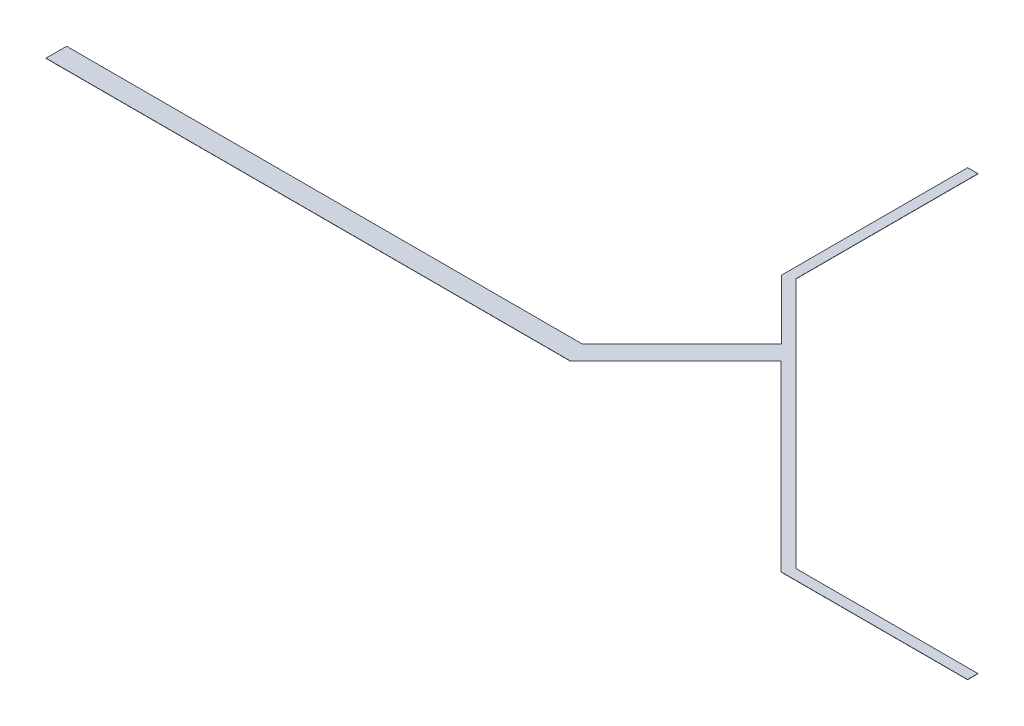
ISO-10303-21;
HEADER;
FILE_DESCRIPTION(('STEP AP214'),'2;1');
FILE_NAME('part.step','',(''),(''),'','','');
FILE_SCHEMA(('AUTOMOTIVE_DESIGN { 1 0 10303 214 1 1 1 1 }'));
ENDSEC;
DATA;
#1=APPLICATION_CONTEXT('core data for automotive mechanical design processes');
#2=APPLICATION_PROTOCOL_DEFINITION('international standard','automotive_design',2000,#1);
#3=PRODUCT_CONTEXT('',#1,'mechanical');
#4=PRODUCT('Part','Part','',(#3));
#5=PRODUCT_RELATED_PRODUCT_CATEGORY('part','',(#4));
#6=PRODUCT_DEFINITION_FORMATION('','',#4);
#7=PRODUCT_DEFINITION_CONTEXT('part definition',#1,'design');
#8=PRODUCT_DEFINITION('design','',#6,#7);
#9=PRODUCT_DEFINITION_SHAPE('','',#8);
#10=(LENGTH_UNIT() NAMED_UNIT(*) SI_UNIT(.MILLI.,.METRE.));
#11=(NAMED_UNIT(*) PLANE_ANGLE_UNIT() SI_UNIT($,.RADIAN.));
#12=(NAMED_UNIT(*) SI_UNIT($,.STERADIAN.) SOLID_ANGLE_UNIT());
#13=UNCERTAINTY_MEASURE_WITH_UNIT(LENGTH_MEASURE(1.E-05),#10,'distance_accuracy_value','');
#14=(GEOMETRIC_REPRESENTATION_CONTEXT(3) GLOBAL_UNCERTAINTY_ASSIGNED_CONTEXT((#13)) GLOBAL_UNIT_ASSIGNED_CONTEXT((#10,
#11,#12)) REPRESENTATION_CONTEXT('',''));
#15=CARTESIAN_POINT('',(0.,0.,0.));
#16=DIRECTION('',(0.,0.,1.));
#17=DIRECTION('',(1.,0.,0.));
#18=AXIS2_PLACEMENT_3D('',#15,#16,#17);
#19=CARTESIAN_POINT('',(11.2391618815923,0.0175,-1.00621977316114));
#20=DIRECTION('',(0.,0.,-1.));
#21=DIRECTION('',(-1.,0.,0.));
#22=AXIS2_PLACEMENT_3D('',#19,#20,#21);
#23=PLANE('',#22);
#24=DIRECTION('',(1.,0.,0.));
#25=VECTOR('',#24,1.);
#26=CARTESIAN_POINT('',(11.2391618815923,0.0025,-1.00621977316114));
#27=LINE('',#26,#25);
#28=CARTESIAN_POINT('',(11.2391618815923,0.0025,-1.00621977316114));
#29=VERTEX_POINT('',#28);
#30=CARTESIAN_POINT('',(49.3616618815923,0.0025,-1.00621977316114));
#31=VERTEX_POINT('',#30);
#32=EDGE_CURVE('E167',#29,#31,#27,.T.);
#33=ORIENTED_EDGE('',*,*,#32,.T.);
#34=DIRECTION('',(0.,-1.,0.));
#35=VECTOR('',#34,1.);
#36=CARTESIAN_POINT('',(49.3616618815923,0.0175,-1.00621977316114));
#37=LINE('',#36,#35);
#38=CARTESIAN_POINT('',(49.3616618815923,0.0175,-1.00621977316114));
#39=VERTEX_POINT('',#38);
#40=EDGE_CURVE('E11',#39,#31,#37,.T.);
#41=ORIENTED_EDGE('',*,*,#40,.F.);
#42=DIRECTION('',(1.,0.,0.));
#43=VECTOR('',#42,1.);
#44=CARTESIAN_POINT('',(11.2391618815923,0.0175,-1.00621977316114));
#45=LINE('',#44,#43);
#46=CARTESIAN_POINT('',(11.2391618815923,0.0175,-1.00621977316114));
#47=VERTEX_POINT('',#46);
#48=EDGE_CURVE('E193',#47,#39,#45,.T.);
#49=ORIENTED_EDGE('',*,*,#48,.F.);
#50=DIRECTION('',(0.,-1.,0.));
#51=VECTOR('',#50,1.);
#52=CARTESIAN_POINT('',(11.2391618815923,0.0175,-1.00621977316114));
#53=LINE('',#52,#51);
#54=EDGE_CURVE('E163',#47,#29,#53,.T.);
#55=ORIENTED_EDGE('',*,*,#54,.T.);
#56=EDGE_LOOP('',(#33,#41,#49,#55));
#57=FACE_BOUND('',#56,.T.);
#58=ADVANCED_FACE('F35',(#57),#23,.F.);
#59=CARTESIAN_POINT('',(49.3616618815923,0.0175,-1.00621977316114));
#60=DIRECTION('',(-0.707106781186549,0.,-0.707106781186546));
#61=DIRECTION('',(-0.707106781186546,0.,0.707106781186549));
#62=AXIS2_PLACEMENT_3D('',#59,#60,#61);
#63=PLANE('',#62);
#64=DIRECTION('',(0.707106781186546,0.,-0.707106781186549));
#65=VECTOR('',#64,1.);
#66=CARTESIAN_POINT('',(49.3616618815923,0.0025,-1.00621977316114));
#67=LINE('',#66,#65);
#68=CARTESIAN_POINT('',(57.0355382244192,0.0025,-8.68009611598817));
#69=VERTEX_POINT('',#68);
#70=EDGE_CURVE('E170',#31,#69,#67,.T.);
#71=ORIENTED_EDGE('',*,*,#70,.T.);
#72=DIRECTION('',(0.,-1.,0.));
#73=VECTOR('',#72,1.);
#74=CARTESIAN_POINT('',(57.0355382244192,0.0175,-8.68009611598817));
#75=LINE('',#74,#73);
#76=CARTESIAN_POINT('',(57.0355382244192,0.0175,-8.68009611598817));
#77=VERTEX_POINT('',#76);
#78=EDGE_CURVE('E43',#77,#69,#75,.T.);
#79=ORIENTED_EDGE('',*,*,#78,.F.);
#80=DIRECTION('',(0.707106781186546,0.,-0.707106781186549));
#81=VECTOR('',#80,1.);
#82=CARTESIAN_POINT('',(49.3616618815923,0.0175,-1.00621977316114));
#83=LINE('',#82,#81);
#84=EDGE_CURVE('E112',#39,#77,#83,.T.);
#85=ORIENTED_EDGE('',*,*,#84,.F.);
#86=ORIENTED_EDGE('',*,*,#40,.T.);
#87=EDGE_LOOP('',(#71,#79,#85,#86));
#88=FACE_BOUND('',#87,.T.);
#89=ADVANCED_FACE('F281',(#88),#63,.F.);
#90=CARTESIAN_POINT('',(57.0355382244192,0.0175,-8.68009611598817));
#91=DIRECTION('',(0.707106781186548,0.,-0.707106781186547));
#92=DIRECTION('',(-0.707106781186547,0.,-0.707106781186548));
#93=AXIS2_PLACEMENT_3D('',#90,#91,#92);
#94=PLANE('',#93);
#95=DIRECTION('',(0.707106781186547,0.,0.707106781186548));
#96=VECTOR('',#95,1.);
#97=CARTESIAN_POINT('',(57.0355382244192,0.0025,-8.68009611598817));
#98=LINE('',#97,#96);
#99=CARTESIAN_POINT('',(70.3309134776793,0.0025,4.61527913727193));
#100=VERTEX_POINT('',#99);
#101=EDGE_CURVE('E172',#69,#100,#98,.T.);
#102=ORIENTED_EDGE('',*,*,#101,.T.);
#103=DIRECTION('',(0.,-1.,0.));
#104=VECTOR('',#103,1.);
#105=CARTESIAN_POINT('',(70.3309134776793,0.0175,4.61527913727193));
#106=LINE('',#105,#104);
#107=CARTESIAN_POINT('',(70.3309134776793,0.0175,4.61527913727193));
#108=VERTEX_POINT('',#107);
#109=EDGE_CURVE('E218',#108,#100,#106,.T.);
#110=ORIENTED_EDGE('',*,*,#109,.F.);
#111=DIRECTION('',(0.707106781186547,0.,0.707106781186548));
#112=VECTOR('',#111,1.);
#113=CARTESIAN_POINT('',(57.0355382244192,0.0175,-8.68009611598817));
#114=LINE('',#113,#112);
#115=EDGE_CURVE('E226',#77,#108,#114,.T.);
#116=ORIENTED_EDGE('',*,*,#115,.F.);
#117=ORIENTED_EDGE('',*,*,#78,.T.);
#118=EDGE_LOOP('',(#102,#110,#116,#117));
#119=FACE_BOUND('',#118,.T.);
#120=ADVANCED_FACE('F224',(#119),#94,.F.);
#121=CARTESIAN_POINT('',(70.3309134776793,0.0175,4.61527913727193));
#122=DIRECTION('',(0.,0.,-1.));
#123=DIRECTION('',(-1.,0.,0.));
#124=AXIS2_PLACEMENT_3D('',#121,#122,#123);
#125=PLANE('',#124);
#126=DIRECTION('',(1.,0.,0.));
#127=VECTOR('',#126,1.);
#128=CARTESIAN_POINT('',(70.3309134776793,0.0025,4.61527913727193));
#129=LINE('',#128,#127);
#130=CARTESIAN_POINT('',(83.8909134776793,0.0025,4.61527913727191));
#131=VERTEX_POINT('',#130);
#132=EDGE_CURVE('E174',#100,#131,#129,.T.);
#133=ORIENTED_EDGE('',*,*,#132,.T.);
#134=DIRECTION('',(0.,-1.,0.));
#135=VECTOR('',#134,1.);
#136=CARTESIAN_POINT('',(83.8909134776793,0.0175,4.61527913727191));
#137=LINE('',#136,#135);
#138=CARTESIAN_POINT('',(83.8909134776793,0.0175,4.61527913727191));
#139=VERTEX_POINT('',#138);
#140=EDGE_CURVE('E215',#139,#131,#137,.T.);
#141=ORIENTED_EDGE('',*,*,#140,.F.);
#142=DIRECTION('',(1.,0.,0.));
#143=VECTOR('',#142,1.);
#144=CARTESIAN_POINT('',(70.3309134776793,0.0175,4.61527913727193));
#145=LINE('',#144,#143);
#146=EDGE_CURVE('E244',#108,#139,#145,.T.);
#147=ORIENTED_EDGE('',*,*,#146,.F.);
#148=ORIENTED_EDGE('',*,*,#109,.T.);
#149=EDGE_LOOP('',(#133,#141,#147,#148));
#150=FACE_BOUND('',#149,.T.);
#151=ADVANCED_FACE('F235',(#150),#125,.F.);
#152=CARTESIAN_POINT('',(83.8909134776793,0.0175,4.61527913727191));
#153=DIRECTION('',(-1.,0.,0.));
#154=DIRECTION('',(0.,0.,1.));
#155=AXIS2_PLACEMENT_3D('',#152,#153,#154);
#156=PLANE('',#155);
#157=DIRECTION('',(0.,0.,-1.));
#158=VECTOR('',#157,1.);
#159=CARTESIAN_POINT('',(83.8909134776793,0.0025,4.61527913727191));
#160=LINE('',#159,#158);
#161=CARTESIAN_POINT('',(83.8909134776793,0.0025,3.86527913727191));
#162=VERTEX_POINT('',#161);
#163=EDGE_CURVE('E176',#131,#162,#160,.T.);
#164=ORIENTED_EDGE('',*,*,#163,.T.);
#165=DIRECTION('',(0.,-1.,0.));
#166=VECTOR('',#165,1.);
#167=CARTESIAN_POINT('',(83.8909134776793,0.0175,3.86527913727191));
#168=LINE('',#167,#166);
#169=CARTESIAN_POINT('',(83.8909134776793,0.0175,3.86527913727191));
#170=VERTEX_POINT('',#169);
#171=EDGE_CURVE('E212',#170,#162,#168,.T.);
#172=ORIENTED_EDGE('',*,*,#171,.F.);
#173=DIRECTION('',(0.,0.,-1.));
#174=VECTOR('',#173,1.);
#175=CARTESIAN_POINT('',(83.8909134776793,0.0175,4.61527913727191));
#176=LINE('',#175,#174);
#177=EDGE_CURVE('E241',#139,#170,#176,.T.);
#178=ORIENTED_EDGE('',*,*,#177,.F.);
#179=ORIENTED_EDGE('',*,*,#140,.T.);
#180=EDGE_LOOP('',(#164,#172,#178,#179));
#181=FACE_BOUND('',#180,.T.);
#182=ADVANCED_FACE('F239',(#181),#156,.F.);
#183=CARTESIAN_POINT('',(83.8909134776793,0.0175,3.86527913727191));
#184=DIRECTION('',(0.,0.,1.));
#185=DIRECTION('',(1.,0.,0.));
#186=AXIS2_PLACEMENT_3D('',#183,#184,#185);
#187=PLANE('',#186);
#188=DIRECTION('',(-1.,0.,0.));
#189=VECTOR('',#188,1.);
#190=CARTESIAN_POINT('',(83.8909134776793,0.0025,3.86527913727191));
#191=LINE('',#190,#189);
#192=CARTESIAN_POINT('',(70.6459134776793,0.0025,3.86527913727191));
#193=VERTEX_POINT('',#192);
#194=EDGE_CURVE('E178',#162,#193,#191,.T.);
#195=ORIENTED_EDGE('',*,*,#194,.T.);
#196=DIRECTION('',(0.,-1.,0.));
#197=VECTOR('',#196,1.);
#198=CARTESIAN_POINT('',(70.6459134776793,0.0175,3.86527913727191));
#199=LINE('',#198,#197);
#200=CARTESIAN_POINT('',(70.6459134776793,0.0175,3.86527913727191));
#201=VERTEX_POINT('',#200);
#202=EDGE_CURVE('E209',#201,#193,#199,.T.);
#203=ORIENTED_EDGE('',*,*,#202,.F.);
#204=DIRECTION('',(-1.,0.,0.));
#205=VECTOR('',#204,1.);
#206=CARTESIAN_POINT('',(83.8909134776793,0.0175,3.86527913727191));
#207=LINE('',#206,#205);
#208=EDGE_CURVE('E243',#170,#201,#207,.T.);
#209=ORIENTED_EDGE('',*,*,#208,.F.);
#210=ORIENTED_EDGE('',*,*,#171,.T.);
#211=EDGE_LOOP('',(#195,#203,#209,#210));
#212=FACE_BOUND('',#211,.T.);
#213=ADVANCED_FACE('F294',(#212),#187,.F.);
#214=CARTESIAN_POINT('',(52.4059773539868,0.0175,-14.3824156455612));
#215=DIRECTION('',(-0.707257123013171,0.,0.70695640738813));
#216=DIRECTION('',(0.70695640738813,0.,0.707257123013171));
#217=AXIS2_PLACEMENT_3D('',#214,#215,#216);
#218=PLANE('',#217);
#219=DIRECTION('',(-0.70695640738813,0.,-0.707257123013171));
#220=VECTOR('',#219,1.);
#221=CARTESIAN_POINT('',(52.4059773539868,0.0025,-14.3824156455612));
#222=LINE('',#221,#220);
#223=CARTESIAN_POINT('',(52.4059773539868,0.0025,-14.3824156455612));
#224=VERTEX_POINT('',#223);
#225=EDGE_CURVE('E180',#193,#224,#222,.T.);
#226=ORIENTED_EDGE('',*,*,#225,.T.);
#227=DIRECTION('',(0.,-1.,0.));
#228=VECTOR('',#227,1.);
#229=CARTESIAN_POINT('',(52.4059773539868,0.0175,-14.3824156455612));
#230=LINE('',#229,#228);
#231=CARTESIAN_POINT('',(52.4059773539868,0.0175,-14.3824156455612));
#232=VERTEX_POINT('',#231);
#233=EDGE_CURVE('E206',#232,#224,#230,.T.);
#234=ORIENTED_EDGE('',*,*,#233,.F.);
#235=DIRECTION('',(-0.70695640738813,0.,-0.707257123013171));
#236=VECTOR('',#235,1.);
#237=CARTESIAN_POINT('',(52.4059773539868,0.0175,-14.3824156455612));
#238=LINE('',#237,#236);
#239=EDGE_CURVE('E246',#201,#232,#238,.T.);
#240=ORIENTED_EDGE('',*,*,#239,.F.);
#241=ORIENTED_EDGE('',*,*,#202,.T.);
#242=EDGE_LOOP('',(#226,#234,#240,#241));
#243=FACE_BOUND('',#242,.T.);
#244=ADVANCED_FACE('F297',(#243),#218,.F.);
#245=CARTESIAN_POINT('',(52.4059773539868,0.0175,-27.6274156455612));
#246=DIRECTION('',(-1.,0.,0.));
#247=DIRECTION('',(0.,0.,1.));
#248=AXIS2_PLACEMENT_3D('',#245,#246,#247);
#249=PLANE('',#248);
#250=DIRECTION('',(0.,0.,-1.));
#251=VECTOR('',#250,1.);
#252=CARTESIAN_POINT('',(52.4059773539868,0.0025,-27.6274156455612));
#253=LINE('',#252,#251);
#254=CARTESIAN_POINT('',(52.4059773539868,0.0025,-27.6274156455612));
#255=VERTEX_POINT('',#254);
#256=EDGE_CURVE('E182',#224,#255,#253,.T.);
#257=ORIENTED_EDGE('',*,*,#256,.T.);
#258=DIRECTION('',(0.,-1.,0.));
#259=VECTOR('',#258,1.);
#260=CARTESIAN_POINT('',(52.4059773539868,0.0175,-27.6274156455612));
#261=LINE('',#260,#259);
#262=CARTESIAN_POINT('',(52.4059773539868,0.0175,-27.6274156455612));
#263=VERTEX_POINT('',#262);
#264=EDGE_CURVE('E203',#263,#255,#261,.T.);
#265=ORIENTED_EDGE('',*,*,#264,.F.);
#266=DIRECTION('',(0.,0.,-1.));
#267=VECTOR('',#266,1.);
#268=CARTESIAN_POINT('',(52.4059773539868,0.0175,-27.6274156455612));
#269=LINE('',#268,#267);
#270=EDGE_CURVE('E252',#232,#263,#269,.T.);
#271=ORIENTED_EDGE('',*,*,#270,.F.);
#272=ORIENTED_EDGE('',*,*,#233,.T.);
#273=EDGE_LOOP('',(#257,#265,#271,#272));
#274=FACE_BOUND('',#273,.T.);
#275=ADVANCED_FACE('F301',(#274),#249,.F.);
#276=CARTESIAN_POINT('',(51.6559773539868,0.0175,-27.6274156455612));
#277=DIRECTION('',(0.,0.,1.));
#278=DIRECTION('',(1.,0.,0.));
#279=AXIS2_PLACEMENT_3D('',#276,#277,#278);
#280=PLANE('',#279);
#281=DIRECTION('',(-1.,0.,0.));
#282=VECTOR('',#281,1.);
#283=CARTESIAN_POINT('',(51.6559773539868,0.0025,-27.6274156455612));
#284=LINE('',#283,#282);
#285=CARTESIAN_POINT('',(51.6559773539868,0.0025,-27.6274156455612));
#286=VERTEX_POINT('',#285);
#287=EDGE_CURVE('E184',#255,#286,#284,.T.);
#288=ORIENTED_EDGE('',*,*,#287,.T.);
#289=DIRECTION('',(0.,-1.,0.));
#290=VECTOR('',#289,1.);
#291=CARTESIAN_POINT('',(51.6559773539868,0.0175,-27.6274156455612));
#292=LINE('',#291,#290);
#293=CARTESIAN_POINT('',(51.6559773539868,0.0175,-27.6274156455612));
#294=VERTEX_POINT('',#293);
#295=EDGE_CURVE('E200',#294,#286,#292,.T.);
#296=ORIENTED_EDGE('',*,*,#295,.F.);
#297=DIRECTION('',(-1.,0.,0.));
#298=VECTOR('',#297,1.);
#299=CARTESIAN_POINT('',(51.6559773539868,0.0175,-27.6274156455612));
#300=LINE('',#299,#298);
#301=EDGE_CURVE('E254',#263,#294,#300,.T.);
#302=ORIENTED_EDGE('',*,*,#301,.F.);
#303=ORIENTED_EDGE('',*,*,#264,.T.);
#304=EDGE_LOOP('',(#288,#296,#302,#303));
#305=FACE_BOUND('',#304,.T.);
#306=ADVANCED_FACE('F305',(#305),#280,.F.);
#307=CARTESIAN_POINT('',(51.6559773539868,0.0175,-14.0674156455612));
#308=DIRECTION('',(1.,0.,0.));
#309=DIRECTION('',(0.,0.,-1.));
#310=AXIS2_PLACEMENT_3D('',#307,#308,#309);
#311=PLANE('',#310);
#312=DIRECTION('',(0.,0.,1.));
#313=VECTOR('',#312,1.);
#314=CARTESIAN_POINT('',(51.6559773539868,0.0025,-14.0674156455612));
#315=LINE('',#314,#313);
#316=CARTESIAN_POINT('',(51.6559773539868,0.0025,-14.0674156455612));
#317=VERTEX_POINT('',#316);
#318=EDGE_CURVE('E186',#286,#317,#315,.T.);
#319=ORIENTED_EDGE('',*,*,#318,.T.);
#320=DIRECTION('',(0.,-1.,0.));
#321=VECTOR('',#320,1.);
#322=CARTESIAN_POINT('',(51.6559773539868,0.0175,-14.0674156455612));
#323=LINE('',#322,#321);
#324=CARTESIAN_POINT('',(51.6559773539868,0.0175,-14.0674156455612));
#325=VERTEX_POINT('',#324);
#326=EDGE_CURVE('E197',#325,#317,#323,.T.);
#327=ORIENTED_EDGE('',*,*,#326,.F.);
#328=DIRECTION('',(0.,0.,1.));
#329=VECTOR('',#328,1.);
#330=CARTESIAN_POINT('',(51.6559773539868,0.0175,-14.0674156455612));
#331=LINE('',#330,#329);
#332=EDGE_CURVE('E256',#294,#325,#331,.T.);
#333=ORIENTED_EDGE('',*,*,#332,.F.);
#334=ORIENTED_EDGE('',*,*,#295,.T.);
#335=EDGE_LOOP('',(#319,#327,#333,#334));
#336=FACE_BOUND('',#335,.T.);
#337=ADVANCED_FACE('F262',(#336),#311,.F.);
#338=CARTESIAN_POINT('',(55.9781675539895,0.0175,-9.74522544555844));
#339=DIRECTION('',(0.707106781186548,0.,-0.707106781186547));
#340=DIRECTION('',(-0.707106781186547,0.,-0.707106781186548));
#341=AXIS2_PLACEMENT_3D('',#338,#339,#340);
#342=PLANE('',#341);
#343=DIRECTION('',(0.707106781186547,0.,0.707106781186548));
#344=VECTOR('',#343,1.);
#345=CARTESIAN_POINT('',(55.9781675539895,0.0025,-9.74522544555844));
#346=LINE('',#345,#344);
#347=CARTESIAN_POINT('',(55.9781675539895,0.0025,-9.74522544555844));
#348=VERTEX_POINT('',#347);
#349=EDGE_CURVE('E188',#317,#348,#346,.T.);
#350=ORIENTED_EDGE('',*,*,#349,.T.);
#351=DIRECTION('',(0.,-1.,0.));
#352=VECTOR('',#351,1.);
#353=CARTESIAN_POINT('',(55.9781675539895,0.0175,-9.74522544555844));
#354=LINE('',#353,#352);
#355=CARTESIAN_POINT('',(55.9781675539895,0.0175,-9.74522544555844));
#356=VERTEX_POINT('',#355);
#357=EDGE_CURVE('E158',#356,#348,#354,.T.);
#358=ORIENTED_EDGE('',*,*,#357,.F.);
#359=DIRECTION('',(0.707106781186547,0.,0.707106781186548));
#360=VECTOR('',#359,1.);
#361=CARTESIAN_POINT('',(55.9781675539895,0.0175,-9.74522544555844));
#362=LINE('',#361,#360);
#363=EDGE_CURVE('E149',#325,#356,#362,.T.);
#364=ORIENTED_EDGE('',*,*,#363,.F.);
#365=ORIENTED_EDGE('',*,*,#326,.T.);
#366=EDGE_LOOP('',(#350,#358,#364,#365));
#367=FACE_BOUND('',#366,.T.);
#368=ADVANCED_FACE('F266',(#367),#342,.F.);
#369=CARTESIAN_POINT('',(48.7391618815923,0.0175,-2.50621977316114));
#370=DIRECTION('',(0.707106781186549,0.,0.707106781186546));
#371=DIRECTION('',(0.707106781186546,0.,-0.707106781186549));
#372=AXIS2_PLACEMENT_3D('',#369,#370,#371);
#373=PLANE('',#372);
#374=DIRECTION('',(-0.707106781186546,0.,0.707106781186549));
#375=VECTOR('',#374,1.);
#376=CARTESIAN_POINT('',(48.7391618815923,0.0025,-2.50621977316114));
#377=LINE('',#376,#375);
#378=CARTESIAN_POINT('',(48.7391618815923,0.0025,-2.50621977316114));
#379=VERTEX_POINT('',#378);
#380=EDGE_CURVE('E157',#348,#379,#377,.T.);
#381=ORIENTED_EDGE('',*,*,#380,.T.);
#382=DIRECTION('',(0.,-1.,0.));
#383=VECTOR('',#382,1.);
#384=CARTESIAN_POINT('',(48.7391618815923,0.0175,-2.50621977316114));
#385=LINE('',#384,#383);
#386=CARTESIAN_POINT('',(48.7391618815923,0.0175,-2.50621977316114));
#387=VERTEX_POINT('',#386);
#388=EDGE_CURVE('E154',#387,#379,#385,.T.);
#389=ORIENTED_EDGE('',*,*,#388,.F.);
#390=DIRECTION('',(-0.707106781186546,0.,0.707106781186549));
#391=VECTOR('',#390,1.);
#392=CARTESIAN_POINT('',(48.7391618815923,0.0175,-2.50621977316114));
#393=LINE('',#392,#391);
#394=EDGE_CURVE('E143',#356,#387,#393,.T.);
#395=ORIENTED_EDGE('',*,*,#394,.F.);
#396=ORIENTED_EDGE('',*,*,#357,.T.);
#397=EDGE_LOOP('',(#381,#389,#395,#396));
#398=FACE_BOUND('',#397,.T.);
#399=ADVANCED_FACE('F155',(#398),#373,.F.);
#400=CARTESIAN_POINT('',(11.2391618815923,0.0175,-2.50621977316114));
#401=DIRECTION('',(0.,0.,1.));
#402=DIRECTION('',(1.,0.,0.));
#403=AXIS2_PLACEMENT_3D('',#400,#401,#402);
#404=PLANE('',#403);
#405=DIRECTION('',(-1.,0.,0.));
#406=VECTOR('',#405,1.);
#407=CARTESIAN_POINT('',(11.2391618815923,0.0025,-2.50621977316114));
#408=LINE('',#407,#406);
#409=CARTESIAN_POINT('',(11.2391618815923,0.0025,-2.50621977316114));
#410=VERTEX_POINT('',#409);
#411=EDGE_CURVE('E98',#379,#410,#408,.T.);
#412=ORIENTED_EDGE('',*,*,#411,.T.);
#413=DIRECTION('',(0.,-1.,0.));
#414=VECTOR('',#413,1.);
#415=CARTESIAN_POINT('',(11.2391618815923,0.0175,-2.50621977316114));
#416=LINE('',#415,#414);
#417=CARTESIAN_POINT('',(11.2391618815923,0.0175,-2.50621977316114));
#418=VERTEX_POINT('',#417);
#419=EDGE_CURVE('E159',#418,#410,#416,.T.);
#420=ORIENTED_EDGE('',*,*,#419,.F.);
#421=DIRECTION('',(-1.,0.,0.));
#422=VECTOR('',#421,1.);
#423=CARTESIAN_POINT('',(11.2391618815923,0.0175,-2.50621977316114));
#424=LINE('',#423,#422);
#425=EDGE_CURVE('E147',#387,#418,#424,.T.);
#426=ORIENTED_EDGE('',*,*,#425,.F.);
#427=ORIENTED_EDGE('',*,*,#388,.T.);
#428=EDGE_LOOP('',(#412,#420,#426,#427));
#429=FACE_BOUND('',#428,.T.);
#430=ADVANCED_FACE('F161',(#429),#404,.F.);
#431=CARTESIAN_POINT('',(11.2391618815923,0.0175,-1.00621977316114));
#432=DIRECTION('',(1.,0.,0.));
#433=DIRECTION('',(0.,0.,-1.));
#434=AXIS2_PLACEMENT_3D('',#431,#432,#433);
#435=PLANE('',#434);
#436=DIRECTION('',(0.,0.,1.));
#437=VECTOR('',#436,1.);
#438=CARTESIAN_POINT('',(11.2391618815923,0.0025,-1.00621977316114));
#439=LINE('',#438,#437);
#440=EDGE_CURVE('E104',#410,#29,#439,.T.);
#441=ORIENTED_EDGE('',*,*,#440,.T.);
#442=ORIENTED_EDGE('',*,*,#54,.F.);
#443=DIRECTION('',(0.,0.,1.));
#444=VECTOR('',#443,1.);
#445=CARTESIAN_POINT('',(11.2391618815923,0.0175,-1.00621977316114));
#446=LINE('',#445,#444);
#447=EDGE_CURVE('E51',#418,#47,#446,.T.);
#448=ORIENTED_EDGE('',*,*,#447,.F.);
#449=ORIENTED_EDGE('',*,*,#419,.T.);
#450=EDGE_LOOP('',(#441,#442,#448,#449));
#451=FACE_BOUND('',#450,.T.);
#452=ADVANCED_FACE('F270',(#451),#435,.F.);
#453=CARTESIAN_POINT('',(11.2391618815923,0.0175,-1.00621977316114));
#454=DIRECTION('',(0.,1.,0.));
#455=DIRECTION('',(0.,0.,1.));
#456=AXIS2_PLACEMENT_3D('',#453,#454,#455);
#457=PLANE('',#456);
#458=ORIENTED_EDGE('',*,*,#48,.T.);
#459=ORIENTED_EDGE('',*,*,#84,.T.);
#460=ORIENTED_EDGE('',*,*,#115,.T.);
#461=ORIENTED_EDGE('',*,*,#146,.T.);
#462=ORIENTED_EDGE('',*,*,#177,.T.);
#463=ORIENTED_EDGE('',*,*,#208,.T.);
#464=ORIENTED_EDGE('',*,*,#239,.T.);
#465=ORIENTED_EDGE('',*,*,#270,.T.);
#466=ORIENTED_EDGE('',*,*,#301,.T.);
#467=ORIENTED_EDGE('',*,*,#332,.T.);
#468=ORIENTED_EDGE('',*,*,#363,.T.);
#469=ORIENTED_EDGE('',*,*,#394,.T.);
#470=ORIENTED_EDGE('',*,*,#425,.T.);
#471=ORIENTED_EDGE('',*,*,#447,.T.);
#472=EDGE_LOOP('',(#458,#459,#460,#461,#462,#463,#464,#465,#466,#467,#468,#469,#470,#471));
#473=FACE_BOUND('',#472,.T.);
#474=ADVANCED_FACE('F145',(#473),#457,.T.);
#475=CARTESIAN_POINT('',(11.2391618815923,0.0025,-1.00621977316114));
#476=DIRECTION('',(0.,1.,0.));
#477=DIRECTION('',(0.,0.,1.));
#478=AXIS2_PLACEMENT_3D('',#475,#476,#477);
#479=PLANE('',#478);
#480=ORIENTED_EDGE('',*,*,#32,.F.);
#481=ORIENTED_EDGE('',*,*,#440,.F.);
#482=ORIENTED_EDGE('',*,*,#411,.F.);
#483=ORIENTED_EDGE('',*,*,#380,.F.);
#484=ORIENTED_EDGE('',*,*,#349,.F.);
#485=ORIENTED_EDGE('',*,*,#318,.F.);
#486=ORIENTED_EDGE('',*,*,#287,.F.);
#487=ORIENTED_EDGE('',*,*,#256,.F.);
#488=ORIENTED_EDGE('',*,*,#225,.F.);
#489=ORIENTED_EDGE('',*,*,#194,.F.);
#490=ORIENTED_EDGE('',*,*,#163,.F.);
#491=ORIENTED_EDGE('',*,*,#132,.F.);
#492=ORIENTED_EDGE('',*,*,#101,.F.);
#493=ORIENTED_EDGE('',*,*,#70,.F.);
#494=EDGE_LOOP('',(#480,#481,#482,#483,#484,#485,#486,#487,#488,#489,#490,#491,#492,#493));
#495=FACE_BOUND('',#494,.T.);
#496=ADVANCED_FACE('F230',(#495),#479,.F.);
#497=CLOSED_SHELL('',(#58,#89,#120,#151,#182,#213,#244,#275,#306,#337,#368,#399,#430,#452,#474,#496));
#498=MANIFOLD_SOLID_BREP('B2',#497);
#499=ADVANCED_BREP_SHAPE_REPRESENTATION('',(#18,#498),#14);
#500=SHAPE_DEFINITION_REPRESENTATION(#9,#499);
ENDSEC;
END-ISO-10303-21;
